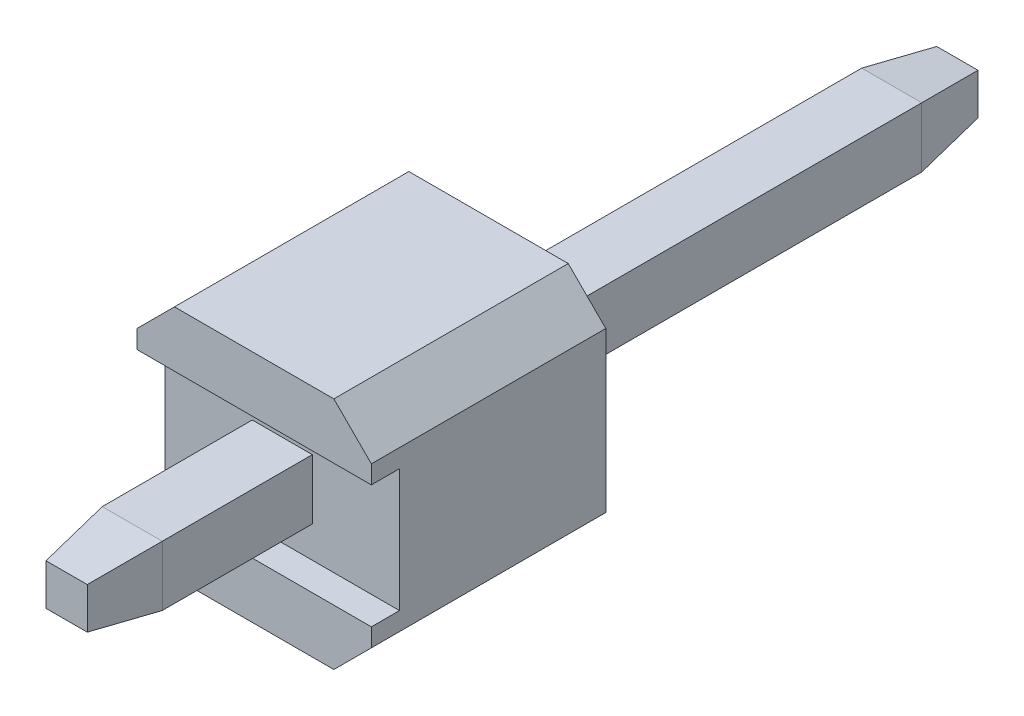
ISO-10303-21;
HEADER;
FILE_DESCRIPTION(('STEP AP214'),'2;1');
FILE_NAME('part.step','',(''),(''),'','','');
FILE_SCHEMA(('AUTOMOTIVE_DESIGN { 1 0 10303 214 1 1 1 1 }'));
ENDSEC;
DATA;
#1=APPLICATION_CONTEXT('core data for automotive mechanical design processes');
#2=APPLICATION_PROTOCOL_DEFINITION('international standard','automotive_design',2000,#1);
#3=PRODUCT_CONTEXT('',#1,'mechanical');
#4=PRODUCT('Part','Part','',(#3));
#5=PRODUCT_RELATED_PRODUCT_CATEGORY('part','',(#4));
#6=PRODUCT_DEFINITION_FORMATION('','',#4);
#7=PRODUCT_DEFINITION_CONTEXT('part definition',#1,'design');
#8=PRODUCT_DEFINITION('design','',#6,#7);
#9=PRODUCT_DEFINITION_SHAPE('','',#8);
#10=(LENGTH_UNIT() NAMED_UNIT(*) SI_UNIT(.MILLI.,.METRE.));
#11=(NAMED_UNIT(*) PLANE_ANGLE_UNIT() SI_UNIT($,.RADIAN.));
#12=(NAMED_UNIT(*) SI_UNIT($,.STERADIAN.) SOLID_ANGLE_UNIT());
#13=UNCERTAINTY_MEASURE_WITH_UNIT(LENGTH_MEASURE(1.E-05),#10,'distance_accuracy_value','');
#14=(GEOMETRIC_REPRESENTATION_CONTEXT(3) GLOBAL_UNCERTAINTY_ASSIGNED_CONTEXT((#13)) GLOBAL_UNIT_ASSIGNED_CONTEXT((#10,
#11,#12)) REPRESENTATION_CONTEXT('',''));
#15=CARTESIAN_POINT('',(0.,0.,0.));
#16=DIRECTION('',(0.,0.,1.));
#17=DIRECTION('',(1.,0.,0.));
#18=AXIS2_PLACEMENT_3D('',#15,#16,#17);
#19=CARTESIAN_POINT('',(-0.16,-0.27,-4.65));
#20=DIRECTION('',(0.,-0.989949493661167,-0.14142135623731));
#21=DIRECTION('',(0.,0.14142135623731,-0.989949493661167));
#22=AXIS2_PLACEMENT_3D('',#19,#20,#21);
#23=PLANE('',#22);
#24=DIRECTION('',(1.,0.,0.));
#25=VECTOR('',#24,1.);
#26=CARTESIAN_POINT('',(-0.16,-0.22,-5.));
#27=LINE('',#26,#25);
#28=CARTESIAN_POINT('',(-0.22,-0.22,-5.));
#29=VERTEX_POINT('',#28);
#30=CARTESIAN_POINT('',(0.22,-0.22,-5.));
#31=VERTEX_POINT('',#30);
#32=EDGE_CURVE('P0_E11',#29,#31,#27,.T.);
#33=ORIENTED_EDGE('',*,*,#32,.T.);
#34=DIRECTION('',(0.140028008402801,-0.140028008402801,0.980196058819607));
#35=VECTOR('',#34,1.);
#36=CARTESIAN_POINT('',(0.22,-0.22,-5.));
#37=LINE('',#36,#35);
#38=CARTESIAN_POINT('',(0.32,-0.32,-4.3));
#39=VERTEX_POINT('',#38);
#40=EDGE_CURVE('P0_E28',#31,#39,#37,.T.);
#41=ORIENTED_EDGE('',*,*,#40,.T.);
#42=DIRECTION('',(-1.,0.,0.));
#43=VECTOR('',#42,1.);
#44=CARTESIAN_POINT('',(-0.16,-0.32,-4.3));
#45=LINE('',#44,#43);
#46=CARTESIAN_POINT('',(-0.32,-0.32,-4.3));
#47=VERTEX_POINT('',#46);
#48=EDGE_CURVE('P0_E141',#39,#47,#45,.T.);
#49=ORIENTED_EDGE('',*,*,#48,.T.);
#50=DIRECTION('',(-0.140028008402801,-0.140028008402801,0.980196058819607));
#51=VECTOR('',#50,1.);
#52=CARTESIAN_POINT('',(-0.22,-0.22,-5.));
#53=LINE('',#52,#51);
#54=EDGE_CURVE('P0_E106',#29,#47,#53,.T.);
#55=ORIENTED_EDGE('',*,*,#54,.F.);
#56=EDGE_LOOP('',(#33,#41,#49,#55));
#57=FACE_BOUND('',#56,.T.);
#58=ADVANCED_FACE('P0_F17',(#57),#23,.T.);
#59=CARTESIAN_POINT('',(0.27,-0.16,-4.65));
#60=DIRECTION('',(0.989949493661167,0.,-0.14142135623731));
#61=DIRECTION('',(0.,-1.,0.));
#62=AXIS2_PLACEMENT_3D('',#59,#60,#61);
#63=PLANE('',#62);
#64=DIRECTION('',(0.,1.,0.));
#65=VECTOR('',#64,1.);
#66=CARTESIAN_POINT('',(0.22,-0.16,-5.));
#67=LINE('',#66,#65);
#68=CARTESIAN_POINT('',(0.22,0.22,-5.));
#69=VERTEX_POINT('',#68);
#70=EDGE_CURVE('P0_E160',#31,#69,#67,.T.);
#71=ORIENTED_EDGE('',*,*,#70,.T.);
#72=DIRECTION('',(0.140028008402801,0.140028008402801,0.980196058819607));
#73=VECTOR('',#72,1.);
#74=CARTESIAN_POINT('',(0.22,0.22,-5.));
#75=LINE('',#74,#73);
#76=CARTESIAN_POINT('',(0.32,0.32,-4.3));
#77=VERTEX_POINT('',#76);
#78=EDGE_CURVE('P0_E21',#69,#77,#75,.T.);
#79=ORIENTED_EDGE('',*,*,#78,.T.);
#80=DIRECTION('',(0.,-1.,0.));
#81=VECTOR('',#80,1.);
#82=CARTESIAN_POINT('',(0.32,-0.16,-4.3));
#83=LINE('',#82,#81);
#84=EDGE_CURVE('P0_E146',#77,#39,#83,.T.);
#85=ORIENTED_EDGE('',*,*,#84,.T.);
#86=ORIENTED_EDGE('',*,*,#40,.F.);
#87=EDGE_LOOP('',(#71,#79,#85,#86));
#88=FACE_BOUND('',#87,.T.);
#89=ADVANCED_FACE('P0_F223',(#88),#63,.T.);
#90=CARTESIAN_POINT('',(0.16,0.27,-4.65));
#91=DIRECTION('',(0.,0.989949493661167,-0.14142135623731));
#92=DIRECTION('',(-1.,0.,0.));
#93=AXIS2_PLACEMENT_3D('',#90,#91,#92);
#94=PLANE('',#93);
#95=DIRECTION('',(-1.,0.,0.));
#96=VECTOR('',#95,1.);
#97=CARTESIAN_POINT('',(0.16,0.22,-5.));
#98=LINE('',#97,#96);
#99=CARTESIAN_POINT('',(-0.22,0.22,-5.));
#100=VERTEX_POINT('',#99);
#101=EDGE_CURVE('P0_E139',#69,#100,#98,.T.);
#102=ORIENTED_EDGE('',*,*,#101,.T.);
#103=DIRECTION('',(-0.140028008402801,0.140028008402801,0.980196058819607));
#104=VECTOR('',#103,1.);
#105=CARTESIAN_POINT('',(-0.22,0.22,-5.));
#106=LINE('',#105,#104);
#107=CARTESIAN_POINT('',(-0.32,0.32,-4.3));
#108=VERTEX_POINT('',#107);
#109=EDGE_CURVE('P0_E135',#100,#108,#106,.T.);
#110=ORIENTED_EDGE('',*,*,#109,.T.);
#111=DIRECTION('',(1.,0.,0.));
#112=VECTOR('',#111,1.);
#113=CARTESIAN_POINT('',(0.16,0.32,-4.3));
#114=LINE('',#113,#112);
#115=EDGE_CURVE('P0_E132',#108,#77,#114,.T.);
#116=ORIENTED_EDGE('',*,*,#115,.T.);
#117=ORIENTED_EDGE('',*,*,#78,.F.);
#118=EDGE_LOOP('',(#102,#110,#116,#117));
#119=FACE_BOUND('',#118,.T.);
#120=ADVANCED_FACE('P0_F239',(#119),#94,.T.);
#121=CARTESIAN_POINT('',(-0.27,0.16,-4.65));
#122=DIRECTION('',(-0.989949493661167,0.,-0.14142135623731));
#123=DIRECTION('',(-0.14142135623731,0.,0.989949493661167));
#124=AXIS2_PLACEMENT_3D('',#121,#122,#123);
#125=PLANE('',#124);
#126=DIRECTION('',(0.,1.,0.));
#127=VECTOR('',#126,1.);
#128=CARTESIAN_POINT('',(-0.32,0.16,-4.3));
#129=LINE('',#128,#127);
#130=EDGE_CURVE('P0_E101',#47,#108,#129,.T.);
#131=ORIENTED_EDGE('',*,*,#130,.T.);
#132=ORIENTED_EDGE('',*,*,#109,.F.);
#133=DIRECTION('',(0.,-1.,0.));
#134=VECTOR('',#133,1.);
#135=CARTESIAN_POINT('',(-0.22,0.16,-5.));
#136=LINE('',#135,#134);
#137=EDGE_CURVE('P0_E128',#100,#29,#136,.T.);
#138=ORIENTED_EDGE('',*,*,#137,.T.);
#139=ORIENTED_EDGE('',*,*,#54,.T.);
#140=EDGE_LOOP('',(#131,#132,#138,#139));
#141=FACE_BOUND('',#140,.T.);
#142=ADVANCED_FACE('P0_F244',(#141),#125,.T.);
#143=CARTESIAN_POINT('',(-0.32,0.32,0.));
#144=DIRECTION('',(-1.,0.,0.));
#145=DIRECTION('',(0.,0.,1.));
#146=AXIS2_PLACEMENT_3D('',#143,#144,#145);
#147=PLANE('',#146);
#148=ORIENTED_EDGE('',*,*,#130,.F.);
#149=DIRECTION('',(0.,0.,1.));
#150=VECTOR('',#149,1.);
#151=CARTESIAN_POINT('',(-0.32,-0.32,0.));
#152=LINE('',#151,#150);
#153=CARTESIAN_POINT('',(-0.32,-0.32,2.));
#154=VERTEX_POINT('',#153);
#155=EDGE_CURVE('P0_E100',#47,#154,#152,.T.);
#156=ORIENTED_EDGE('',*,*,#155,.T.);
#157=DIRECTION('',(0.,-1.,0.));
#158=VECTOR('',#157,1.);
#159=CARTESIAN_POINT('',(-0.32,0.16,2.));
#160=LINE('',#159,#158);
#161=CARTESIAN_POINT('',(-0.32,0.32,2.));
#162=VERTEX_POINT('',#161);
#163=EDGE_CURVE('P0_E88',#162,#154,#160,.T.);
#164=ORIENTED_EDGE('',*,*,#163,.F.);
#165=DIRECTION('',(0.,0.,1.));
#166=VECTOR('',#165,1.);
#167=CARTESIAN_POINT('',(-0.32,0.32,0.));
#168=LINE('',#167,#166);
#169=EDGE_CURVE('P0_E121',#108,#162,#168,.T.);
#170=ORIENTED_EDGE('',*,*,#169,.F.);
#171=EDGE_LOOP('',(#148,#156,#164,#170));
#172=FACE_BOUND('',#171,.T.);
#173=ADVANCED_FACE('P0_F19',(#172),#147,.T.);
#174=CARTESIAN_POINT('',(-0.32,-0.32,0.));
#175=DIRECTION('',(0.,-1.,0.));
#176=DIRECTION('',(0.,0.,-1.));
#177=AXIS2_PLACEMENT_3D('',#174,#175,#176);
#178=PLANE('',#177);
#179=ORIENTED_EDGE('',*,*,#48,.F.);
#180=DIRECTION('',(0.,0.,1.));
#181=VECTOR('',#180,1.);
#182=CARTESIAN_POINT('',(0.32,-0.32,0.));
#183=LINE('',#182,#181);
#184=CARTESIAN_POINT('',(0.32,-0.32,2.));
#185=VERTEX_POINT('',#184);
#186=EDGE_CURVE('P0_E107',#39,#185,#183,.T.);
#187=ORIENTED_EDGE('',*,*,#186,.T.);
#188=DIRECTION('',(1.,0.,0.));
#189=VECTOR('',#188,1.);
#190=CARTESIAN_POINT('',(-0.16,-0.32,2.));
#191=LINE('',#190,#189);
#192=EDGE_CURVE('P0_E76',#154,#185,#191,.T.);
#193=ORIENTED_EDGE('',*,*,#192,.F.);
#194=ORIENTED_EDGE('',*,*,#155,.F.);
#195=EDGE_LOOP('',(#179,#187,#193,#194));
#196=FACE_BOUND('',#195,.T.);
#197=ADVANCED_FACE('P0_F109',(#196),#178,.T.);
#198=CARTESIAN_POINT('',(0.,0.,-5.));
#199=DIRECTION('',(0.,0.,-1.));
#200=DIRECTION('',(0.,-1.,0.));
#201=AXIS2_PLACEMENT_3D('',#198,#199,#200);
#202=PLANE('',#201);
#203=ORIENTED_EDGE('',*,*,#32,.F.);
#204=ORIENTED_EDGE('',*,*,#137,.F.);
#205=ORIENTED_EDGE('',*,*,#101,.F.);
#206=ORIENTED_EDGE('',*,*,#70,.F.);
#207=EDGE_LOOP('',(#203,#204,#205,#206));
#208=FACE_BOUND('',#207,.T.);
#209=ADVANCED_FACE('P0_F229',(#208),#202,.T.);
#210=CARTESIAN_POINT('',(0.32,-0.32,0.));
#211=DIRECTION('',(1.,0.,0.));
#212=DIRECTION('',(0.,1.,0.));
#213=AXIS2_PLACEMENT_3D('',#210,#211,#212);
#214=PLANE('',#213);
#215=ORIENTED_EDGE('',*,*,#84,.F.);
#216=DIRECTION('',(0.,0.,-1.));
#217=VECTOR('',#216,1.);
#218=CARTESIAN_POINT('',(0.32,0.32,0.));
#219=LINE('',#218,#217);
#220=CARTESIAN_POINT('',(0.32,0.32,2.));
#221=VERTEX_POINT('',#220);
#222=EDGE_CURVE('P0_E124',#221,#77,#219,.T.);
#223=ORIENTED_EDGE('',*,*,#222,.F.);
#224=DIRECTION('',(0.,1.,0.));
#225=VECTOR('',#224,1.);
#226=CARTESIAN_POINT('',(0.32,-0.16,2.));
#227=LINE('',#226,#225);
#228=EDGE_CURVE('P0_E67',#185,#221,#227,.T.);
#229=ORIENTED_EDGE('',*,*,#228,.F.);
#230=ORIENTED_EDGE('',*,*,#186,.F.);
#231=EDGE_LOOP('',(#215,#223,#229,#230));
#232=FACE_BOUND('',#231,.T.);
#233=ADVANCED_FACE('P0_F212',(#232),#214,.T.);
#234=CARTESIAN_POINT('',(0.32,0.32,0.));
#235=DIRECTION('',(0.,1.,0.));
#236=DIRECTION('',(1.,0.,0.));
#237=AXIS2_PLACEMENT_3D('',#234,#235,#236);
#238=PLANE('',#237);
#239=ORIENTED_EDGE('',*,*,#115,.F.);
#240=ORIENTED_EDGE('',*,*,#169,.T.);
#241=DIRECTION('',(-1.,0.,0.));
#242=VECTOR('',#241,1.);
#243=CARTESIAN_POINT('',(0.16,0.32,2.));
#244=LINE('',#243,#242);
#245=EDGE_CURVE('P0_E92',#221,#162,#244,.T.);
#246=ORIENTED_EDGE('',*,*,#245,.F.);
#247=ORIENTED_EDGE('',*,*,#222,.T.);
#248=EDGE_LOOP('',(#239,#240,#246,#247));
#249=FACE_BOUND('',#248,.T.);
#250=ADVANCED_FACE('P0_F207',(#249),#238,.T.);
#251=CARTESIAN_POINT('',(0.,0.,2.));
#252=DIRECTION('',(0.,0.,1.));
#253=DIRECTION('',(1.,0.,0.));
#254=AXIS2_PLACEMENT_3D('',#251,#252,#253);
#255=PLANE('',#254);
#256=ORIENTED_EDGE('',*,*,#245,.T.);
#257=ORIENTED_EDGE('',*,*,#163,.T.);
#258=ORIENTED_EDGE('',*,*,#192,.T.);
#259=ORIENTED_EDGE('',*,*,#228,.T.);
#260=EDGE_LOOP('',(#256,#257,#258,#259));
#261=FACE_BOUND('',#260,.T.);
#262=ADVANCED_FACE('P0_F90',(#261),#255,.T.);
#263=CLOSED_SHELL('',(#58,#89,#120,#142,#173,#197,#209,#233,#250,#262));
#264=MANIFOLD_SOLID_BREP('P0_B1',#263);
#265=CARTESIAN_POINT('',(-1.25,0.655430015301126,2.5));
#266=DIRECTION('',(0.,1.,0.));
#267=DIRECTION('',(1.,0.,0.));
#268=AXIS2_PLACEMENT_3D('',#265,#266,#267);
#269=PLANE('',#268);
#270=DIRECTION('',(1.,0.,0.));
#271=VECTOR('',#270,1.);
#272=CARTESIAN_POINT('',(-0.625,0.655430015301126,2.5));
#273=LINE('',#272,#271);
#274=CARTESIAN_POINT('',(-1.25,0.655430015301126,2.5));
#275=VERTEX_POINT('',#274);
#276=CARTESIAN_POINT('',(1.25,0.655430015301126,2.5));
#277=VERTEX_POINT('',#276);
#278=EDGE_CURVE('P1_E224',#275,#277,#273,.T.);
#279=ORIENTED_EDGE('',*,*,#278,.F.);
#280=DIRECTION('',(0.,0.,1.));
#281=VECTOR('',#280,1.);
#282=CARTESIAN_POINT('',(-1.25,0.655430015301126,1.25));
#283=LINE('',#282,#281);
#284=CARTESIAN_POINT('',(-1.25,0.655430015301126,2.2));
#285=VERTEX_POINT('',#284);
#286=EDGE_CURVE('P1_E42',#285,#275,#283,.T.);
#287=ORIENTED_EDGE('',*,*,#286,.F.);
#288=DIRECTION('',(1.,0.,0.));
#289=VECTOR('',#288,1.);
#290=CARTESIAN_POINT('',(-1.25,0.655430015301126,2.2));
#291=LINE('',#290,#289);
#292=CARTESIAN_POINT('',(1.25,0.655430015301126,2.2));
#293=VERTEX_POINT('',#292);
#294=EDGE_CURVE('P1_E11',#285,#293,#291,.T.);
#295=ORIENTED_EDGE('',*,*,#294,.T.);
#296=DIRECTION('',(0.,0.,-1.));
#297=VECTOR('',#296,1.);
#298=CARTESIAN_POINT('',(1.25,0.655430015301126,1.25));
#299=LINE('',#298,#297);
#300=EDGE_CURVE('P1_E367',#277,#293,#299,.T.);
#301=ORIENTED_EDGE('',*,*,#300,.F.);
#302=EDGE_LOOP('',(#279,#287,#295,#301));
#303=FACE_BOUND('',#302,.T.);
#304=ADVANCED_FACE('P1_F17',(#303),#269,.F.);
#305=CARTESIAN_POINT('',(1.25,-0.655430015301126,2.5));
#306=DIRECTION('',(0.,-1.,0.));
#307=DIRECTION('',(0.,0.,-1.));
#308=AXIS2_PLACEMENT_3D('',#305,#306,#307);
#309=PLANE('',#308);
#310=DIRECTION('',(-1.,0.,0.));
#311=VECTOR('',#310,1.);
#312=CARTESIAN_POINT('',(0.625,-0.655430015301126,2.5));
#313=LINE('',#312,#311);
#314=CARTESIAN_POINT('',(1.25,-0.655430015301126,2.5));
#315=VERTEX_POINT('',#314);
#316=CARTESIAN_POINT('',(-1.25,-0.655430015301126,2.5));
#317=VERTEX_POINT('',#316);
#318=EDGE_CURVE('P1_E288',#315,#317,#313,.T.);
#319=ORIENTED_EDGE('',*,*,#318,.F.);
#320=DIRECTION('',(0.,0.,1.));
#321=VECTOR('',#320,1.);
#322=CARTESIAN_POINT('',(1.25,-0.655430015301126,1.25));
#323=LINE('',#322,#321);
#324=CARTESIAN_POINT('',(1.25,-0.655430015301126,2.2));
#325=VERTEX_POINT('',#324);
#326=EDGE_CURVE('P1_E216',#325,#315,#323,.T.);
#327=ORIENTED_EDGE('',*,*,#326,.F.);
#328=DIRECTION('',(-1.,0.,0.));
#329=VECTOR('',#328,1.);
#330=CARTESIAN_POINT('',(1.25,-0.655430015301126,2.2));
#331=LINE('',#330,#329);
#332=CARTESIAN_POINT('',(-1.25,-0.655430015301126,2.2));
#333=VERTEX_POINT('',#332);
#334=EDGE_CURVE('P1_E28',#325,#333,#331,.T.);
#335=ORIENTED_EDGE('',*,*,#334,.T.);
#336=DIRECTION('',(0.,0.,-1.));
#337=VECTOR('',#336,1.);
#338=CARTESIAN_POINT('',(-1.25,-0.655430015301126,1.25));
#339=LINE('',#338,#337);
#340=EDGE_CURVE('P1_E210',#317,#333,#339,.T.);
#341=ORIENTED_EDGE('',*,*,#340,.F.);
#342=EDGE_LOOP('',(#319,#327,#335,#341));
#343=FACE_BOUND('',#342,.T.);
#344=ADVANCED_FACE('P1_F525',(#343),#309,.F.);
#345=CARTESIAN_POINT('',(0.,0.,2.2));
#346=DIRECTION('',(0.,0.,-1.));
#347=DIRECTION('',(0.,-1.,0.));
#348=AXIS2_PLACEMENT_3D('',#345,#346,#347);
#349=PLANE('',#348);
#350=DIRECTION('',(0.,-1.,0.));
#351=VECTOR('',#350,1.);
#352=CARTESIAN_POINT('',(1.25,-0.625,2.2));
#353=LINE('',#352,#351);
#354=EDGE_CURVE('P1_E219',#293,#325,#353,.T.);
#355=ORIENTED_EDGE('',*,*,#354,.F.);
#356=ORIENTED_EDGE('',*,*,#294,.F.);
#357=DIRECTION('',(0.,1.,0.));
#358=VECTOR('',#357,1.);
#359=CARTESIAN_POINT('',(-1.25,0.625,2.2));
#360=LINE('',#359,#358);
#361=EDGE_CURVE('P1_E301',#333,#285,#360,.T.);
#362=ORIENTED_EDGE('',*,*,#361,.F.);
#363=ORIENTED_EDGE('',*,*,#334,.F.);
#364=EDGE_LOOP('',(#355,#356,#362,#363));
#365=FACE_BOUND('',#364,.T.);
#366=DIRECTION('',(0.,-1.,0.));
#367=VECTOR('',#366,1.);
#368=CARTESIAN_POINT('',(-0.32,-0.16,2.2));
#369=LINE('',#368,#367);
#370=CARTESIAN_POINT('',(-0.32,0.32,2.2));
#371=VERTEX_POINT('',#370);
#372=CARTESIAN_POINT('',(-0.32,-0.32,2.2));
#373=VERTEX_POINT('',#372);
#374=EDGE_CURVE('P1_E181',#371,#373,#369,.T.);
#375=ORIENTED_EDGE('',*,*,#374,.F.);
#376=DIRECTION('',(-1.,0.,0.));
#377=VECTOR('',#376,1.);
#378=CARTESIAN_POINT('',(-0.16,0.32,2.2));
#379=LINE('',#378,#377);
#380=CARTESIAN_POINT('',(0.32,0.32,2.2));
#381=VERTEX_POINT('',#380);
#382=EDGE_CURVE('P1_E244',#381,#371,#379,.T.);
#383=ORIENTED_EDGE('',*,*,#382,.F.);
#384=DIRECTION('',(0.,1.,0.));
#385=VECTOR('',#384,1.);
#386=CARTESIAN_POINT('',(0.32,0.16,2.2));
#387=LINE('',#386,#385);
#388=CARTESIAN_POINT('',(0.32,-0.32,2.2));
#389=VERTEX_POINT('',#388);
#390=EDGE_CURVE('P1_E183',#389,#381,#387,.T.);
#391=ORIENTED_EDGE('',*,*,#390,.F.);
#392=DIRECTION('',(1.,0.,0.));
#393=VECTOR('',#392,1.);
#394=CARTESIAN_POINT('',(0.16,-0.32,2.2));
#395=LINE('',#394,#393);
#396=EDGE_CURVE('P1_E178',#373,#389,#395,.T.);
#397=ORIENTED_EDGE('',*,*,#396,.F.);
#398=EDGE_LOOP('',(#375,#383,#391,#397));
#399=FACE_BOUND('',#398,.T.);
#400=ADVANCED_FACE('P1_F180',(#365,#399),#349,.F.);
#401=CARTESIAN_POINT('',(0.,0.,2.5));
#402=DIRECTION('',(0.,0.,1.));
#403=DIRECTION('',(1.,0.,0.));
#404=AXIS2_PLACEMENT_3D('',#401,#402,#403);
#405=PLANE('',#404);
#406=ORIENTED_EDGE('',*,*,#318,.T.);
#407=DIRECTION('',(0.,-1.,0.));
#408=VECTOR('',#407,1.);
#409=CARTESIAN_POINT('',(-1.25,-1.25,2.5));
#410=LINE('',#409,#408);
#411=CARTESIAN_POINT('',(-1.25,-0.85,2.5));
#412=VERTEX_POINT('',#411);
#413=EDGE_CURVE('P1_E339',#317,#412,#410,.T.);
#414=ORIENTED_EDGE('',*,*,#413,.T.);
#415=DIRECTION('',(-0.707106781186548,0.707106781186548,0.));
#416=VECTOR('',#415,1.);
#417=CARTESIAN_POINT('',(-1.05,-1.05,2.5));
#418=LINE('',#417,#416);
#419=CARTESIAN_POINT('',(-0.85,-1.25,2.5));
#420=VERTEX_POINT('',#419);
#421=EDGE_CURVE('P1_E336',#420,#412,#418,.T.);
#422=ORIENTED_EDGE('',*,*,#421,.F.);
#423=DIRECTION('',(1.,0.,0.));
#424=VECTOR('',#423,1.);
#425=CARTESIAN_POINT('',(1.25,-1.25,2.5));
#426=LINE('',#425,#424);
#427=CARTESIAN_POINT('',(0.85,-1.25,2.5));
#428=VERTEX_POINT('',#427);
#429=EDGE_CURVE('P1_E236',#420,#428,#426,.T.);
#430=ORIENTED_EDGE('',*,*,#429,.T.);
#431=DIRECTION('',(-0.707106781186548,-0.707106781186548,0.));
#432=VECTOR('',#431,1.);
#433=CARTESIAN_POINT('',(1.05,-1.05,2.5));
#434=LINE('',#433,#432);
#435=CARTESIAN_POINT('',(1.25,-0.85,2.5));
#436=VERTEX_POINT('',#435);
#437=EDGE_CURVE('P1_E293',#436,#428,#434,.T.);
#438=ORIENTED_EDGE('',*,*,#437,.F.);
#439=DIRECTION('',(0.,1.,0.));
#440=VECTOR('',#439,1.);
#441=CARTESIAN_POINT('',(1.25,1.25,2.5));
#442=LINE('',#441,#440);
#443=EDGE_CURVE('P1_E232',#436,#315,#442,.T.);
#444=ORIENTED_EDGE('',*,*,#443,.T.);
#445=EDGE_LOOP('',(#406,#414,#422,#430,#438,#444));
#446=FACE_BOUND('',#445,.T.);
#447=ADVANCED_FACE('P1_F331',(#446),#405,.T.);
#448=CARTESIAN_POINT('',(0.,0.,2.5));
#449=DIRECTION('',(0.,0.,1.));
#450=DIRECTION('',(1.,0.,0.));
#451=AXIS2_PLACEMENT_3D('',#448,#449,#450);
#452=PLANE('',#451);
#453=ORIENTED_EDGE('',*,*,#278,.T.);
#454=DIRECTION('',(0.,1.,0.));
#455=VECTOR('',#454,1.);
#456=CARTESIAN_POINT('',(1.25,1.25,2.5));
#457=LINE('',#456,#455);
#458=CARTESIAN_POINT('',(1.25,0.85,2.5));
#459=VERTEX_POINT('',#458);
#460=EDGE_CURVE('P1_E220',#277,#459,#457,.T.);
#461=ORIENTED_EDGE('',*,*,#460,.T.);
#462=DIRECTION('',(0.707106781186548,-0.707106781186548,0.));
#463=VECTOR('',#462,1.);
#464=CARTESIAN_POINT('',(1.05,1.05,2.5));
#465=LINE('',#464,#463);
#466=CARTESIAN_POINT('',(0.85,1.25,2.5));
#467=VERTEX_POINT('',#466);
#468=EDGE_CURVE('P1_E278',#467,#459,#465,.T.);
#469=ORIENTED_EDGE('',*,*,#468,.F.);
#470=DIRECTION('',(-1.,0.,0.));
#471=VECTOR('',#470,1.);
#472=CARTESIAN_POINT('',(-1.25,1.25,2.5));
#473=LINE('',#472,#471);
#474=CARTESIAN_POINT('',(-0.85,1.25,2.5));
#475=VERTEX_POINT('',#474);
#476=EDGE_CURVE('P1_E225',#467,#475,#473,.T.);
#477=ORIENTED_EDGE('',*,*,#476,.T.);
#478=DIRECTION('',(0.707106781186548,0.707106781186548,0.));
#479=VECTOR('',#478,1.);
#480=CARTESIAN_POINT('',(-1.05,1.05,2.5));
#481=LINE('',#480,#479);
#482=CARTESIAN_POINT('',(-1.25,0.85,2.5));
#483=VERTEX_POINT('',#482);
#484=EDGE_CURVE('P1_E230',#483,#475,#481,.T.);
#485=ORIENTED_EDGE('',*,*,#484,.F.);
#486=DIRECTION('',(0.,-1.,0.));
#487=VECTOR('',#486,1.);
#488=CARTESIAN_POINT('',(-1.25,-1.25,2.5));
#489=LINE('',#488,#487);
#490=EDGE_CURVE('P1_E214',#483,#275,#489,.T.);
#491=ORIENTED_EDGE('',*,*,#490,.T.);
#492=EDGE_LOOP('',(#453,#461,#469,#477,#485,#491));
#493=FACE_BOUND('',#492,.T.);
#494=ADVANCED_FACE('P1_F585',(#493),#452,.T.);
#495=CARTESIAN_POINT('',(1.25,-1.25,0.));
#496=DIRECTION('',(1.,0.,0.));
#497=DIRECTION('',(0.,1.,0.));
#498=AXIS2_PLACEMENT_3D('',#495,#496,#497);
#499=PLANE('',#498);
#500=ORIENTED_EDGE('',*,*,#300,.T.);
#501=ORIENTED_EDGE('',*,*,#354,.T.);
#502=ORIENTED_EDGE('',*,*,#326,.T.);
#503=ORIENTED_EDGE('',*,*,#443,.F.);
#504=DIRECTION('',(0.,0.,1.));
#505=VECTOR('',#504,1.);
#506=CARTESIAN_POINT('',(1.25,-0.85,0.));
#507=LINE('',#506,#505);
#508=CARTESIAN_POINT('',(1.25,-0.85,0.));
#509=VERTEX_POINT('',#508);
#510=EDGE_CURVE('P1_E196',#509,#436,#507,.T.);
#511=ORIENTED_EDGE('',*,*,#510,.F.);
#512=DIRECTION('',(0.,-1.,0.));
#513=VECTOR('',#512,1.);
#514=CARTESIAN_POINT('',(1.25,1.25,0.));
#515=LINE('',#514,#513);
#516=CARTESIAN_POINT('',(1.25,0.85,0.));
#517=VERTEX_POINT('',#516);
#518=EDGE_CURVE('P1_E256',#517,#509,#515,.T.);
#519=ORIENTED_EDGE('',*,*,#518,.F.);
#520=DIRECTION('',(0.,0.,-1.));
#521=VECTOR('',#520,1.);
#522=CARTESIAN_POINT('',(1.25,0.85,0.));
#523=LINE('',#522,#521);
#524=EDGE_CURVE('P1_E158',#459,#517,#523,.T.);
#525=ORIENTED_EDGE('',*,*,#524,.F.);
#526=ORIENTED_EDGE('',*,*,#460,.F.);
#527=EDGE_LOOP('',(#500,#501,#502,#503,#511,#519,#525,#526));
#528=FACE_BOUND('',#527,.T.);
#529=ADVANCED_FACE('P1_F324',(#528),#499,.T.);
#530=CARTESIAN_POINT('',(0.32,0.32,0.));
#531=DIRECTION('',(-1.,0.,0.));
#532=DIRECTION('',(0.,0.,1.));
#533=AXIS2_PLACEMENT_3D('',#530,#531,#532);
#534=PLANE('',#533);
#535=ORIENTED_EDGE('',*,*,#390,.T.);
#536=DIRECTION('',(0.,0.,1.));
#537=VECTOR('',#536,1.);
#538=CARTESIAN_POINT('',(0.32,0.32,0.));
#539=LINE('',#538,#537);
#540=CARTESIAN_POINT('',(0.32,0.32,0.));
#541=VERTEX_POINT('',#540);
#542=EDGE_CURVE('P1_E147',#541,#381,#539,.T.);
#543=ORIENTED_EDGE('',*,*,#542,.F.);
#544=DIRECTION('',(0.,-1.,0.));
#545=VECTOR('',#544,1.);
#546=CARTESIAN_POINT('',(0.32,0.32,0.));
#547=LINE('',#546,#545);
#548=CARTESIAN_POINT('',(0.32,-0.32,0.));
#549=VERTEX_POINT('',#548);
#550=EDGE_CURVE('P1_E355',#541,#549,#547,.T.);
#551=ORIENTED_EDGE('',*,*,#550,.T.);
#552=DIRECTION('',(0.,0.,1.));
#553=VECTOR('',#552,1.);
#554=CARTESIAN_POINT('',(0.32,-0.32,0.));
#555=LINE('',#554,#553);
#556=EDGE_CURVE('P1_E139',#549,#389,#555,.T.);
#557=ORIENTED_EDGE('',*,*,#556,.T.);
#558=EDGE_LOOP('',(#535,#543,#551,#557));
#559=FACE_BOUND('',#558,.T.);
#560=ADVANCED_FACE('P1_F358',(#559),#534,.T.);
#561=CARTESIAN_POINT('',(-0.32,0.32,0.));
#562=DIRECTION('',(0.,-1.,0.));
#563=DIRECTION('',(0.,0.,-1.));
#564=AXIS2_PLACEMENT_3D('',#561,#562,#563);
#565=PLANE('',#564);
#566=ORIENTED_EDGE('',*,*,#382,.T.);
#567=DIRECTION('',(0.,0.,1.));
#568=VECTOR('',#567,1.);
#569=CARTESIAN_POINT('',(-0.32,0.32,0.));
#570=LINE('',#569,#568);
#571=CARTESIAN_POINT('',(-0.32,0.32,0.));
#572=VERTEX_POINT('',#571);
#573=EDGE_CURVE('P1_E186',#572,#371,#570,.T.);
#574=ORIENTED_EDGE('',*,*,#573,.F.);
#575=DIRECTION('',(1.,0.,0.));
#576=VECTOR('',#575,1.);
#577=CARTESIAN_POINT('',(-0.32,0.32,0.));
#578=LINE('',#577,#576);
#579=EDGE_CURVE('P1_E240',#572,#541,#578,.T.);
#580=ORIENTED_EDGE('',*,*,#579,.T.);
#581=ORIENTED_EDGE('',*,*,#542,.T.);
#582=EDGE_LOOP('',(#566,#574,#580,#581));
#583=FACE_BOUND('',#582,.T.);
#584=ADVANCED_FACE('P1_F357',(#583),#565,.T.);
#585=CARTESIAN_POINT('',(-1.05,-1.05,0.));
#586=DIRECTION('',(-0.707106781186548,-0.707106781186548,0.));
#587=DIRECTION('',(-0.707106781186548,0.707106781186548,0.));
#588=AXIS2_PLACEMENT_3D('',#585,#586,#587);
#589=PLANE('',#588);
#590=ORIENTED_EDGE('',*,*,#421,.T.);
#591=DIRECTION('',(0.,0.,-1.));
#592=VECTOR('',#591,1.);
#593=CARTESIAN_POINT('',(-1.25,-0.85,0.));
#594=LINE('',#593,#592);
#595=CARTESIAN_POINT('',(-1.25,-0.85,0.));
#596=VERTEX_POINT('',#595);
#597=EDGE_CURVE('P1_E267',#412,#596,#594,.T.);
#598=ORIENTED_EDGE('',*,*,#597,.T.);
#599=DIRECTION('',(0.707106781186548,-0.707106781186548,0.));
#600=VECTOR('',#599,1.);
#601=CARTESIAN_POINT('',(-1.05,-1.05,0.));
#602=LINE('',#601,#600);
#603=CARTESIAN_POINT('',(-0.85,-1.25,0.));
#604=VERTEX_POINT('',#603);
#605=EDGE_CURVE('P1_E260',#596,#604,#602,.T.);
#606=ORIENTED_EDGE('',*,*,#605,.T.);
#607=DIRECTION('',(0.,0.,1.));
#608=VECTOR('',#607,1.);
#609=CARTESIAN_POINT('',(-0.85,-1.25,0.));
#610=LINE('',#609,#608);
#611=EDGE_CURVE('P1_E257',#604,#420,#610,.T.);
#612=ORIENTED_EDGE('',*,*,#611,.T.);
#613=EDGE_LOOP('',(#590,#598,#606,#612));
#614=FACE_BOUND('',#613,.T.);
#615=ADVANCED_FACE('P1_F388',(#614),#589,.T.);
#616=CARTESIAN_POINT('',(-1.25,-1.25,0.));
#617=DIRECTION('',(0.,-1.,0.));
#618=DIRECTION('',(0.,0.,-1.));
#619=AXIS2_PLACEMENT_3D('',#616,#617,#618);
#620=PLANE('',#619);
#621=ORIENTED_EDGE('',*,*,#611,.F.);
#622=DIRECTION('',(-1.,0.,0.));
#623=VECTOR('',#622,1.);
#624=CARTESIAN_POINT('',(1.25,-1.25,0.));
#625=LINE('',#624,#623);
#626=CARTESIAN_POINT('',(0.85,-1.25,0.));
#627=VERTEX_POINT('',#626);
#628=EDGE_CURVE('P1_E297',#627,#604,#625,.T.);
#629=ORIENTED_EDGE('',*,*,#628,.F.);
#630=DIRECTION('',(0.,0.,-1.));
#631=VECTOR('',#630,1.);
#632=CARTESIAN_POINT('',(0.85,-1.25,0.));
#633=LINE('',#632,#631);
#634=EDGE_CURVE('P1_E305',#428,#627,#633,.T.);
#635=ORIENTED_EDGE('',*,*,#634,.F.);
#636=ORIENTED_EDGE('',*,*,#429,.F.);
#637=EDGE_LOOP('',(#621,#629,#635,#636));
#638=FACE_BOUND('',#637,.T.);
#639=ADVANCED_FACE('P1_F340',(#638),#620,.T.);
#640=CARTESIAN_POINT('',(0.,0.,0.));
#641=DIRECTION('',(0.,0.,1.));
#642=DIRECTION('',(1.,0.,0.));
#643=AXIS2_PLACEMENT_3D('',#640,#641,#642);
#644=PLANE('',#643);
#645=ORIENTED_EDGE('',*,*,#605,.F.);
#646=DIRECTION('',(0.,1.,0.));
#647=VECTOR('',#646,1.);
#648=CARTESIAN_POINT('',(-1.25,-1.25,0.));
#649=LINE('',#648,#647);
#650=CARTESIAN_POINT('',(-1.25,0.85,0.));
#651=VERTEX_POINT('',#650);
#652=EDGE_CURVE('P1_E255',#596,#651,#649,.T.);
#653=ORIENTED_EDGE('',*,*,#652,.T.);
#654=DIRECTION('',(-0.707106781186548,-0.707106781186548,0.));
#655=VECTOR('',#654,1.);
#656=CARTESIAN_POINT('',(-1.05,1.05,0.));
#657=LINE('',#656,#655);
#658=CARTESIAN_POINT('',(-0.85,1.25,0.));
#659=VERTEX_POINT('',#658);
#660=EDGE_CURVE('P1_E231',#659,#651,#657,.T.);
#661=ORIENTED_EDGE('',*,*,#660,.F.);
#662=DIRECTION('',(1.,0.,0.));
#663=VECTOR('',#662,1.);
#664=CARTESIAN_POINT('',(-1.25,1.25,0.));
#665=LINE('',#664,#663);
#666=CARTESIAN_POINT('',(0.85,1.25,0.));
#667=VERTEX_POINT('',#666);
#668=EDGE_CURVE('P1_E252',#659,#667,#665,.T.);
#669=ORIENTED_EDGE('',*,*,#668,.T.);
#670=DIRECTION('',(-0.707106781186548,0.707106781186548,0.));
#671=VECTOR('',#670,1.);
#672=CARTESIAN_POINT('',(1.05,1.05,0.));
#673=LINE('',#672,#671);
#674=EDGE_CURVE('P1_E284',#517,#667,#673,.T.);
#675=ORIENTED_EDGE('',*,*,#674,.F.);
#676=ORIENTED_EDGE('',*,*,#518,.T.);
#677=DIRECTION('',(0.707106781186548,0.707106781186548,0.));
#678=VECTOR('',#677,1.);
#679=CARTESIAN_POINT('',(1.05,-1.05,0.));
#680=LINE('',#679,#678);
#681=EDGE_CURVE('P1_E21',#627,#509,#680,.T.);
#682=ORIENTED_EDGE('',*,*,#681,.F.);
#683=ORIENTED_EDGE('',*,*,#628,.T.);
#684=EDGE_LOOP('',(#645,#653,#661,#669,#675,#676,#682,#683));
#685=FACE_BOUND('',#684,.T.);
#686=ORIENTED_EDGE('',*,*,#579,.F.);
#687=DIRECTION('',(0.,1.,0.));
#688=VECTOR('',#687,1.);
#689=CARTESIAN_POINT('',(-0.32,-0.32,0.));
#690=LINE('',#689,#688);
#691=CARTESIAN_POINT('',(-0.32,-0.32,0.));
#692=VERTEX_POINT('',#691);
#693=EDGE_CURVE('P1_E197',#692,#572,#690,.T.);
#694=ORIENTED_EDGE('',*,*,#693,.F.);
#695=DIRECTION('',(-1.,0.,0.));
#696=VECTOR('',#695,1.);
#697=CARTESIAN_POINT('',(0.32,-0.32,0.));
#698=LINE('',#697,#696);
#699=EDGE_CURVE('P1_E187',#549,#692,#698,.T.);
#700=ORIENTED_EDGE('',*,*,#699,.F.);
#701=ORIENTED_EDGE('',*,*,#550,.F.);
#702=EDGE_LOOP('',(#686,#694,#700,#701));
#703=FACE_BOUND('',#702,.T.);
#704=ADVANCED_FACE('P1_F320',(#685,#703),#644,.F.);
#705=CARTESIAN_POINT('',(-1.05,1.05,0.));
#706=DIRECTION('',(-0.707106781186548,0.707106781186548,0.));
#707=DIRECTION('',(0.,0.,1.));
#708=AXIS2_PLACEMENT_3D('',#705,#706,#707);
#709=PLANE('',#708);
#710=ORIENTED_EDGE('',*,*,#484,.T.);
#711=DIRECTION('',(0.,0.,-1.));
#712=VECTOR('',#711,1.);
#713=CARTESIAN_POINT('',(-0.85,1.25,0.));
#714=LINE('',#713,#712);
#715=EDGE_CURVE('P1_E226',#475,#659,#714,.T.);
#716=ORIENTED_EDGE('',*,*,#715,.T.);
#717=ORIENTED_EDGE('',*,*,#660,.T.);
#718=DIRECTION('',(0.,0.,1.));
#719=VECTOR('',#718,1.);
#720=CARTESIAN_POINT('',(-1.25,0.85,0.));
#721=LINE('',#720,#719);
#722=EDGE_CURVE('P1_E251',#651,#483,#721,.T.);
#723=ORIENTED_EDGE('',*,*,#722,.T.);
#724=EDGE_LOOP('',(#710,#716,#717,#723));
#725=FACE_BOUND('',#724,.T.);
#726=ADVANCED_FACE('P1_F532',(#725),#709,.T.);
#727=CARTESIAN_POINT('',(1.25,1.25,0.));
#728=DIRECTION('',(0.,1.,0.));
#729=DIRECTION('',(1.,0.,0.));
#730=AXIS2_PLACEMENT_3D('',#727,#728,#729);
#731=PLANE('',#730);
#732=ORIENTED_EDGE('',*,*,#715,.F.);
#733=ORIENTED_EDGE('',*,*,#476,.F.);
#734=DIRECTION('',(0.,0.,1.));
#735=VECTOR('',#734,1.);
#736=CARTESIAN_POINT('',(0.85,1.25,0.));
#737=LINE('',#736,#735);
#738=EDGE_CURVE('P1_E289',#667,#467,#737,.T.);
#739=ORIENTED_EDGE('',*,*,#738,.F.);
#740=ORIENTED_EDGE('',*,*,#668,.F.);
#741=EDGE_LOOP('',(#732,#733,#739,#740));
#742=FACE_BOUND('',#741,.T.);
#743=ADVANCED_FACE('P1_F537',(#742),#731,.T.);
#744=CARTESIAN_POINT('',(1.05,1.05,0.));
#745=DIRECTION('',(0.707106781186548,0.707106781186548,0.));
#746=DIRECTION('',(0.,0.,-1.));
#747=AXIS2_PLACEMENT_3D('',#744,#745,#746);
#748=PLANE('',#747);
#749=ORIENTED_EDGE('',*,*,#468,.T.);
#750=ORIENTED_EDGE('',*,*,#524,.T.);
#751=ORIENTED_EDGE('',*,*,#674,.T.);
#752=ORIENTED_EDGE('',*,*,#738,.T.);
#753=EDGE_LOOP('',(#749,#750,#751,#752));
#754=FACE_BOUND('',#753,.T.);
#755=ADVANCED_FACE('P1_F568',(#754),#748,.T.);
#756=CARTESIAN_POINT('',(1.05,-1.05,0.));
#757=DIRECTION('',(0.707106781186548,-0.707106781186548,0.));
#758=DIRECTION('',(0.,0.,-1.));
#759=AXIS2_PLACEMENT_3D('',#756,#757,#758);
#760=PLANE('',#759);
#761=ORIENTED_EDGE('',*,*,#437,.T.);
#762=ORIENTED_EDGE('',*,*,#634,.T.);
#763=ORIENTED_EDGE('',*,*,#681,.T.);
#764=ORIENTED_EDGE('',*,*,#510,.T.);
#765=EDGE_LOOP('',(#761,#762,#763,#764));
#766=FACE_BOUND('',#765,.T.);
#767=ADVANCED_FACE('P1_F19',(#766),#760,.T.);
#768=CARTESIAN_POINT('',(-0.32,-0.32,0.));
#769=DIRECTION('',(1.,0.,0.));
#770=DIRECTION('',(0.,1.,0.));
#771=AXIS2_PLACEMENT_3D('',#768,#769,#770);
#772=PLANE('',#771);
#773=ORIENTED_EDGE('',*,*,#374,.T.);
#774=DIRECTION('',(0.,0.,1.));
#775=VECTOR('',#774,1.);
#776=CARTESIAN_POINT('',(-0.32,-0.32,0.));
#777=LINE('',#776,#775);
#778=EDGE_CURVE('P1_E194',#692,#373,#777,.T.);
#779=ORIENTED_EDGE('',*,*,#778,.F.);
#780=ORIENTED_EDGE('',*,*,#693,.T.);
#781=ORIENTED_EDGE('',*,*,#573,.T.);
#782=EDGE_LOOP('',(#773,#779,#780,#781));
#783=FACE_BOUND('',#782,.T.);
#784=ADVANCED_FACE('P1_F192',(#783),#772,.T.);
#785=CARTESIAN_POINT('',(0.32,-0.32,0.));
#786=DIRECTION('',(0.,1.,0.));
#787=DIRECTION('',(1.,0.,0.));
#788=AXIS2_PLACEMENT_3D('',#785,#786,#787);
#789=PLANE('',#788);
#790=ORIENTED_EDGE('',*,*,#396,.T.);
#791=ORIENTED_EDGE('',*,*,#556,.F.);
#792=ORIENTED_EDGE('',*,*,#699,.T.);
#793=ORIENTED_EDGE('',*,*,#778,.T.);
#794=EDGE_LOOP('',(#790,#791,#792,#793));
#795=FACE_BOUND('',#794,.T.);
#796=ADVANCED_FACE('P1_F199',(#795),#789,.T.);
#797=CARTESIAN_POINT('',(-1.25,1.25,0.));
#798=DIRECTION('',(-1.,0.,0.));
#799=DIRECTION('',(0.,0.,1.));
#800=AXIS2_PLACEMENT_3D('',#797,#798,#799);
#801=PLANE('',#800);
#802=ORIENTED_EDGE('',*,*,#286,.T.);
#803=ORIENTED_EDGE('',*,*,#490,.F.);
#804=ORIENTED_EDGE('',*,*,#722,.F.);
#805=ORIENTED_EDGE('',*,*,#652,.F.);
#806=ORIENTED_EDGE('',*,*,#597,.F.);
#807=ORIENTED_EDGE('',*,*,#413,.F.);
#808=ORIENTED_EDGE('',*,*,#340,.T.);
#809=ORIENTED_EDGE('',*,*,#361,.T.);
#810=EDGE_LOOP('',(#802,#803,#804,#805,#806,#807,#808,#809));
#811=FACE_BOUND('',#810,.T.);
#812=ADVANCED_FACE('P1_F387',(#811),#801,.T.);
#813=CLOSED_SHELL('',(#304,#344,#400,#447,#494,#529,#560,#584,#615,#639,#704,#726,#743,#755,
#767,#784,#796,#812));
#814=MANIFOLD_SOLID_BREP('P1_B1',#813);
#815=CARTESIAN_POINT('',(0.27,-0.16,4.15));
#816=DIRECTION('',(0.989949493661167,0.,0.141421356237309));
#817=DIRECTION('',(0.,-1.,0.));
#818=AXIS2_PLACEMENT_3D('',#815,#816,#817);
#819=PLANE('',#818);
#820=DIRECTION('',(0.,-1.,0.));
#821=VECTOR('',#820,1.);
#822=CARTESIAN_POINT('',(0.22,-0.16,4.5));
#823=LINE('',#822,#821);
#824=CARTESIAN_POINT('',(0.22,0.22,4.5));
#825=VERTEX_POINT('',#824);
#826=CARTESIAN_POINT('',(0.22,-0.22,4.5));
#827=VERTEX_POINT('',#826);
#828=EDGE_CURVE('P2_E11',#825,#827,#823,.T.);
#829=ORIENTED_EDGE('',*,*,#828,.T.);
#830=DIRECTION('',(0.140028008402801,-0.140028008402801,-0.980196058819607));
#831=VECTOR('',#830,1.);
#832=CARTESIAN_POINT('',(0.22,-0.22,4.5));
#833=LINE('',#832,#831);
#834=CARTESIAN_POINT('',(0.32,-0.32,3.8));
#835=VERTEX_POINT('',#834);
#836=EDGE_CURVE('P2_E28',#827,#835,#833,.T.);
#837=ORIENTED_EDGE('',*,*,#836,.T.);
#838=DIRECTION('',(0.,1.,0.));
#839=VECTOR('',#838,1.);
#840=CARTESIAN_POINT('',(0.32,-0.16,3.8));
#841=LINE('',#840,#839);
#842=CARTESIAN_POINT('',(0.32,0.32,3.8));
#843=VERTEX_POINT('',#842);
#844=EDGE_CURVE('P2_E136',#835,#843,#841,.T.);
#845=ORIENTED_EDGE('',*,*,#844,.T.);
#846=DIRECTION('',(0.140028008402801,0.140028008402801,-0.980196058819607));
#847=VECTOR('',#846,1.);
#848=CARTESIAN_POINT('',(0.22,0.22,4.5));
#849=LINE('',#848,#847);
#850=EDGE_CURVE('P2_E55',#825,#843,#849,.T.);
#851=ORIENTED_EDGE('',*,*,#850,.F.);
#852=EDGE_LOOP('',(#829,#837,#845,#851));
#853=FACE_BOUND('',#852,.T.);
#854=ADVANCED_FACE('P2_F17',(#853),#819,.T.);
#855=CARTESIAN_POINT('',(-0.16,-0.27,4.15));
#856=DIRECTION('',(0.,-0.989949493661167,0.141421356237309));
#857=DIRECTION('',(-1.,0.,0.));
#858=AXIS2_PLACEMENT_3D('',#855,#856,#857);
#859=PLANE('',#858);
#860=DIRECTION('',(-1.,0.,0.));
#861=VECTOR('',#860,1.);
#862=CARTESIAN_POINT('',(-0.16,-0.22,4.5));
#863=LINE('',#862,#861);
#864=CARTESIAN_POINT('',(-0.22,-0.22,4.5));
#865=VERTEX_POINT('',#864);
#866=EDGE_CURVE('P2_E139',#827,#865,#863,.T.);
#867=ORIENTED_EDGE('',*,*,#866,.T.);
#868=DIRECTION('',(-0.140028008402801,-0.140028008402801,-0.980196058819607));
#869=VECTOR('',#868,1.);
#870=CARTESIAN_POINT('',(-0.22,-0.22,4.5));
#871=LINE('',#870,#869);
#872=CARTESIAN_POINT('',(-0.32,-0.32,3.8));
#873=VERTEX_POINT('',#872);
#874=EDGE_CURVE('P2_E74',#865,#873,#871,.T.);
#875=ORIENTED_EDGE('',*,*,#874,.T.);
#876=DIRECTION('',(1.,0.,0.));
#877=VECTOR('',#876,1.);
#878=CARTESIAN_POINT('',(-0.16,-0.32,3.8));
#879=LINE('',#878,#877);
#880=EDGE_CURVE('P2_E147',#873,#835,#879,.T.);
#881=ORIENTED_EDGE('',*,*,#880,.T.);
#882=ORIENTED_EDGE('',*,*,#836,.F.);
#883=EDGE_LOOP('',(#867,#875,#881,#882));
#884=FACE_BOUND('',#883,.T.);
#885=ADVANCED_FACE('P2_F169',(#884),#859,.T.);
#886=CARTESIAN_POINT('',(-0.27,0.16,4.15));
#887=DIRECTION('',(-0.989949493661167,0.,0.141421356237309));
#888=DIRECTION('',(0.,1.,0.));
#889=AXIS2_PLACEMENT_3D('',#886,#887,#888);
#890=PLANE('',#889);
#891=DIRECTION('',(0.,1.,0.));
#892=VECTOR('',#891,1.);
#893=CARTESIAN_POINT('',(-0.22,0.16,4.5));
#894=LINE('',#893,#892);
#895=CARTESIAN_POINT('',(-0.22,0.22,4.5));
#896=VERTEX_POINT('',#895);
#897=EDGE_CURVE('P2_E144',#865,#896,#894,.T.);
#898=ORIENTED_EDGE('',*,*,#897,.T.);
#899=DIRECTION('',(-0.140028008402801,0.140028008402801,-0.980196058819607));
#900=VECTOR('',#899,1.);
#901=CARTESIAN_POINT('',(-0.22,0.22,4.5));
#902=LINE('',#901,#900);
#903=CARTESIAN_POINT('',(-0.32,0.32,3.8));
#904=VERTEX_POINT('',#903);
#905=EDGE_CURVE('P2_E140',#896,#904,#902,.T.);
#906=ORIENTED_EDGE('',*,*,#905,.T.);
#907=DIRECTION('',(0.,-1.,0.));
#908=VECTOR('',#907,1.);
#909=CARTESIAN_POINT('',(-0.32,0.16,3.8));
#910=LINE('',#909,#908);
#911=EDGE_CURVE('P2_E133',#904,#873,#910,.T.);
#912=ORIENTED_EDGE('',*,*,#911,.T.);
#913=ORIENTED_EDGE('',*,*,#874,.F.);
#914=EDGE_LOOP('',(#898,#906,#912,#913));
#915=FACE_BOUND('',#914,.T.);
#916=ADVANCED_FACE('P2_F300',(#915),#890,.T.);
#917=CARTESIAN_POINT('',(0.16,0.27,4.15));
#918=DIRECTION('',(0.,0.989949493661167,0.141421356237309));
#919=DIRECTION('',(1.,0.,0.));
#920=AXIS2_PLACEMENT_3D('',#917,#918,#919);
#921=PLANE('',#920);
#922=DIRECTION('',(-1.,0.,0.));
#923=VECTOR('',#922,1.);
#924=CARTESIAN_POINT('',(0.16,0.32,3.8));
#925=LINE('',#924,#923);
#926=EDGE_CURVE('P2_E103',#843,#904,#925,.T.);
#927=ORIENTED_EDGE('',*,*,#926,.T.);
#928=ORIENTED_EDGE('',*,*,#905,.F.);
#929=DIRECTION('',(1.,0.,0.));
#930=VECTOR('',#929,1.);
#931=CARTESIAN_POINT('',(0.16,0.22,4.5));
#932=LINE('',#931,#930);
#933=EDGE_CURVE('P2_E134',#896,#825,#932,.T.);
#934=ORIENTED_EDGE('',*,*,#933,.T.);
#935=ORIENTED_EDGE('',*,*,#850,.T.);
#936=EDGE_LOOP('',(#927,#928,#934,#935));
#937=FACE_BOUND('',#936,.T.);
#938=ADVANCED_FACE('P2_F19',(#937),#921,.T.);
#939=CARTESIAN_POINT('',(0.32,0.32,2.));
#940=DIRECTION('',(0.,1.,0.));
#941=DIRECTION('',(1.,0.,0.));
#942=AXIS2_PLACEMENT_3D('',#939,#940,#941);
#943=PLANE('',#942);
#944=ORIENTED_EDGE('',*,*,#926,.F.);
#945=DIRECTION('',(0.,0.,1.));
#946=VECTOR('',#945,1.);
#947=CARTESIAN_POINT('',(0.32,0.32,2.));
#948=LINE('',#947,#946);
#949=CARTESIAN_POINT('',(0.32,0.32,2.));
#950=VERTEX_POINT('',#949);
#951=EDGE_CURVE('P2_E97',#950,#843,#948,.T.);
#952=ORIENTED_EDGE('',*,*,#951,.F.);
#953=DIRECTION('',(-1.,0.,0.));
#954=VECTOR('',#953,1.);
#955=CARTESIAN_POINT('',(0.16,0.32,2.));
#956=LINE('',#955,#954);
#957=CARTESIAN_POINT('',(-0.32,0.32,2.));
#958=VERTEX_POINT('',#957);
#959=EDGE_CURVE('P2_E101',#950,#958,#956,.T.);
#960=ORIENTED_EDGE('',*,*,#959,.T.);
#961=DIRECTION('',(0.,0.,1.));
#962=VECTOR('',#961,1.);
#963=CARTESIAN_POINT('',(-0.32,0.32,2.));
#964=LINE('',#963,#962);
#965=EDGE_CURVE('P2_E118',#958,#904,#964,.T.);
#966=ORIENTED_EDGE('',*,*,#965,.T.);
#967=EDGE_LOOP('',(#944,#952,#960,#966));
#968=FACE_BOUND('',#967,.T.);
#969=ADVANCED_FACE('P2_F99',(#968),#943,.T.);
#970=CARTESIAN_POINT('',(0.32,-0.32,2.));
#971=DIRECTION('',(1.,0.,0.));
#972=DIRECTION('',(0.,1.,0.));
#973=AXIS2_PLACEMENT_3D('',#970,#971,#972);
#974=PLANE('',#973);
#975=ORIENTED_EDGE('',*,*,#844,.F.);
#976=DIRECTION('',(0.,0.,1.));
#977=VECTOR('',#976,1.);
#978=CARTESIAN_POINT('',(0.32,-0.32,2.));
#979=LINE('',#978,#977);
#980=CARTESIAN_POINT('',(0.32,-0.32,2.));
#981=VERTEX_POINT('',#980);
#982=EDGE_CURVE('P2_E122',#981,#835,#979,.T.);
#983=ORIENTED_EDGE('',*,*,#982,.F.);
#984=DIRECTION('',(0.,1.,0.));
#985=VECTOR('',#984,1.);
#986=CARTESIAN_POINT('',(0.32,-0.16,2.));
#987=LINE('',#986,#985);
#988=EDGE_CURVE('P2_E108',#981,#950,#987,.T.);
#989=ORIENTED_EDGE('',*,*,#988,.T.);
#990=ORIENTED_EDGE('',*,*,#951,.T.);
#991=EDGE_LOOP('',(#975,#983,#989,#990));
#992=FACE_BOUND('',#991,.T.);
#993=ADVANCED_FACE('P2_F120',(#992),#974,.T.);
#994=CARTESIAN_POINT('',(0.,0.,4.5));
#995=DIRECTION('',(0.,0.,1.));
#996=DIRECTION('',(1.,0.,0.));
#997=AXIS2_PLACEMENT_3D('',#994,#995,#996);
#998=PLANE('',#997);
#999=ORIENTED_EDGE('',*,*,#828,.F.);
#1000=ORIENTED_EDGE('',*,*,#933,.F.);
#1001=ORIENTED_EDGE('',*,*,#897,.F.);
#1002=ORIENTED_EDGE('',*,*,#866,.F.);
#1003=EDGE_LOOP('',(#999,#1000,#1001,#1002));
#1004=FACE_BOUND('',#1003,.T.);
#1005=ADVANCED_FACE('P2_F265',(#1004),#998,.T.);
#1006=CARTESIAN_POINT('',(-0.32,-0.32,2.));
#1007=DIRECTION('',(0.,-1.,0.));
#1008=DIRECTION('',(0.,0.,-1.));
#1009=AXIS2_PLACEMENT_3D('',#1006,#1007,#1008);
#1010=PLANE('',#1009);
#1011=ORIENTED_EDGE('',*,*,#880,.F.);
#1012=DIRECTION('',(0.,0.,1.));
#1013=VECTOR('',#1012,1.);
#1014=CARTESIAN_POINT('',(-0.32,-0.32,2.));
#1015=LINE('',#1014,#1013);
#1016=CARTESIAN_POINT('',(-0.32,-0.32,2.));
#1017=VERTEX_POINT('',#1016);
#1018=EDGE_CURVE('P2_E152',#1017,#873,#1015,.T.);
#1019=ORIENTED_EDGE('',*,*,#1018,.F.);
#1020=DIRECTION('',(1.,0.,0.));
#1021=VECTOR('',#1020,1.);
#1022=CARTESIAN_POINT('',(-0.16,-0.32,2.));
#1023=LINE('',#1022,#1021);
#1024=EDGE_CURVE('P2_E21',#1017,#981,#1023,.T.);
#1025=ORIENTED_EDGE('',*,*,#1024,.T.);
#1026=ORIENTED_EDGE('',*,*,#982,.T.);
#1027=EDGE_LOOP('',(#1011,#1019,#1025,#1026));
#1028=FACE_BOUND('',#1027,.T.);
#1029=ADVANCED_FACE('P2_F177',(#1028),#1010,.T.);
#1030=CARTESIAN_POINT('',(-0.32,0.32,2.));
#1031=DIRECTION('',(-1.,0.,0.));
#1032=DIRECTION('',(0.,0.,1.));
#1033=AXIS2_PLACEMENT_3D('',#1030,#1031,#1032);
#1034=PLANE('',#1033);
#1035=ORIENTED_EDGE('',*,*,#911,.F.);
#1036=ORIENTED_EDGE('',*,*,#965,.F.);
#1037=DIRECTION('',(0.,-1.,0.));
#1038=VECTOR('',#1037,1.);
#1039=CARTESIAN_POINT('',(-0.32,0.16,2.));
#1040=LINE('',#1039,#1038);
#1041=EDGE_CURVE('P2_E116',#958,#1017,#1040,.T.);
#1042=ORIENTED_EDGE('',*,*,#1041,.T.);
#1043=ORIENTED_EDGE('',*,*,#1018,.T.);
#1044=EDGE_LOOP('',(#1035,#1036,#1042,#1043));
#1045=FACE_BOUND('',#1044,.T.);
#1046=ADVANCED_FACE('P2_F175',(#1045),#1034,.T.);
#1047=CARTESIAN_POINT('',(0.,0.,2.));
#1048=DIRECTION('',(0.,0.,1.));
#1049=DIRECTION('',(1.,0.,0.));
#1050=AXIS2_PLACEMENT_3D('',#1047,#1048,#1049);
#1051=PLANE('',#1050);
#1052=ORIENTED_EDGE('',*,*,#959,.F.);
#1053=ORIENTED_EDGE('',*,*,#988,.F.);
#1054=ORIENTED_EDGE('',*,*,#1024,.F.);
#1055=ORIENTED_EDGE('',*,*,#1041,.F.);
#1056=EDGE_LOOP('',(#1052,#1053,#1054,#1055));
#1057=FACE_BOUND('',#1056,.T.);
#1058=ADVANCED_FACE('P2_F112',(#1057),#1051,.F.);
#1059=CLOSED_SHELL('',(#854,#885,#916,#938,#969,#993,#1005,#1029,#1046,#1058));
#1060=MANIFOLD_SOLID_BREP('P2_B1',#1059);
#1061=ADVANCED_BREP_SHAPE_REPRESENTATION('',(#18,#264,#814,#1060),#14);
#1062=SHAPE_DEFINITION_REPRESENTATION(#9,#1061);
ENDSEC;
END-ISO-10303-21;
